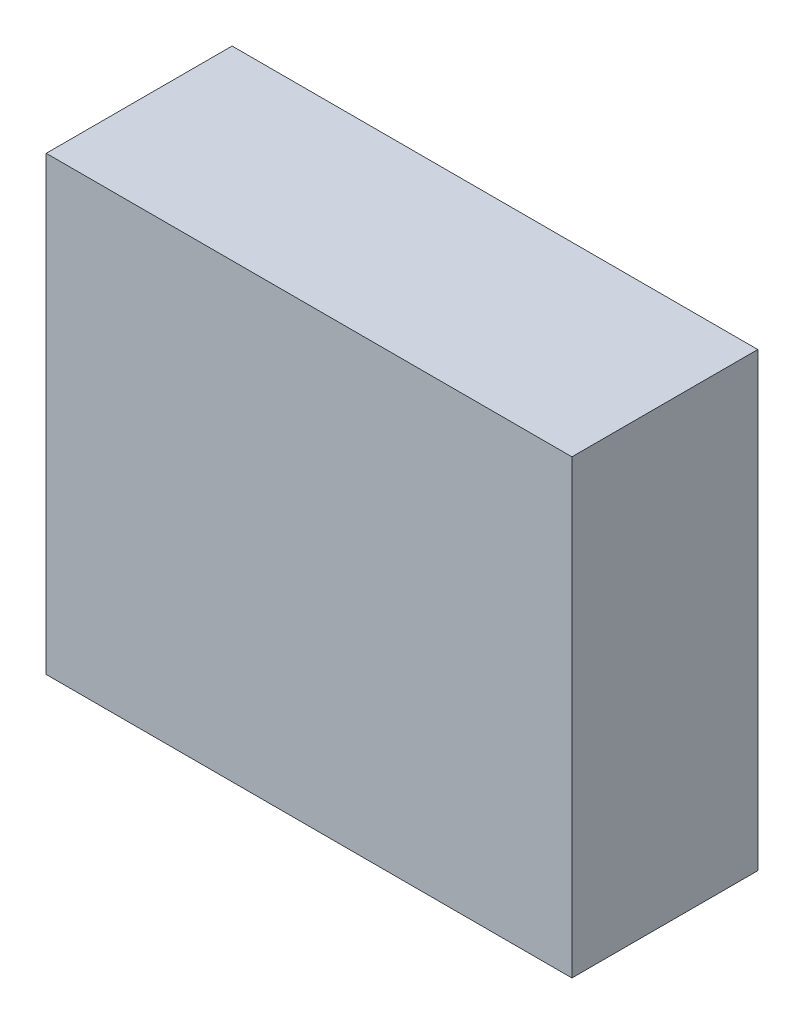
ISO-10303-21;
HEADER;
FILE_DESCRIPTION(('STEP AP214'),'2;1');
FILE_NAME('part.step','',(''),(''),'','','');
FILE_SCHEMA(('AUTOMOTIVE_DESIGN { 1 0 10303 214 1 1 1 1 }'));
ENDSEC;
DATA;
#1=APPLICATION_CONTEXT('core data for automotive mechanical design processes');
#2=APPLICATION_PROTOCOL_DEFINITION('international standard','automotive_design',2000,#1);
#3=PRODUCT_CONTEXT('',#1,'mechanical');
#4=PRODUCT('Part','Part','',(#3));
#5=PRODUCT_RELATED_PRODUCT_CATEGORY('part','',(#4));
#6=PRODUCT_DEFINITION_FORMATION('','',#4);
#7=PRODUCT_DEFINITION_CONTEXT('part definition',#1,'design');
#8=PRODUCT_DEFINITION('design','',#6,#7);
#9=PRODUCT_DEFINITION_SHAPE('','',#8);
#10=(LENGTH_UNIT() NAMED_UNIT(*) SI_UNIT(.MILLI.,.METRE.));
#11=(NAMED_UNIT(*) PLANE_ANGLE_UNIT() SI_UNIT($,.RADIAN.));
#12=(NAMED_UNIT(*) SI_UNIT($,.STERADIAN.) SOLID_ANGLE_UNIT());
#13=UNCERTAINTY_MEASURE_WITH_UNIT(LENGTH_MEASURE(1.E-05),#10,'distance_accuracy_value','');
#14=(GEOMETRIC_REPRESENTATION_CONTEXT(3) GLOBAL_UNCERTAINTY_ASSIGNED_CONTEXT((#13)) GLOBAL_UNIT_ASSIGNED_CONTEXT((#10,
#11,#12)) REPRESENTATION_CONTEXT('',''));
#15=CARTESIAN_POINT('',(0.,0.,0.));
#16=DIRECTION('',(0.,0.,1.));
#17=DIRECTION('',(1.,0.,0.));
#18=AXIS2_PLACEMENT_3D('',#15,#16,#17);
#19=CARTESIAN_POINT('',(49.5,85.,-17.5));
#20=DIRECTION('',(-1.,0.,0.));
#21=DIRECTION('',(0.,0.,1.));
#22=AXIS2_PLACEMENT_3D('',#19,#20,#21);
#23=PLANE('',#22);
#24=DIRECTION('',(0.,0.,-1.));
#25=VECTOR('',#24,1.);
#26=CARTESIAN_POINT('',(49.5,0.,-17.5));
#27=LINE('',#26,#25);
#28=CARTESIAN_POINT('',(49.5,0.,17.5));
#29=VERTEX_POINT('',#28);
#30=CARTESIAN_POINT('',(49.5,0.,-17.5));
#31=VERTEX_POINT('',#30);
#32=EDGE_CURVE('E113',#29,#31,#27,.T.);
#33=ORIENTED_EDGE('',*,*,#32,.T.);
#34=DIRECTION('',(0.,-1.,0.));
#35=VECTOR('',#34,1.);
#36=CARTESIAN_POINT('',(49.5,85.,-17.5));
#37=LINE('',#36,#35);
#38=CARTESIAN_POINT('',(49.5,85.,-17.5));
#39=VERTEX_POINT('',#38);
#40=EDGE_CURVE('E11',#39,#31,#37,.T.);
#41=ORIENTED_EDGE('',*,*,#40,.F.);
#42=DIRECTION('',(0.,0.,-1.));
#43=VECTOR('',#42,1.);
#44=CARTESIAN_POINT('',(49.5,85.,-17.5));
#45=LINE('',#44,#43);
#46=CARTESIAN_POINT('',(49.5,85.,17.5));
#47=VERTEX_POINT('',#46);
#48=EDGE_CURVE('E97',#47,#39,#45,.T.);
#49=ORIENTED_EDGE('',*,*,#48,.F.);
#50=DIRECTION('',(0.,-1.,0.));
#51=VECTOR('',#50,1.);
#52=CARTESIAN_POINT('',(49.5,85.,17.5));
#53=LINE('',#52,#51);
#54=EDGE_CURVE('E109',#47,#29,#53,.T.);
#55=ORIENTED_EDGE('',*,*,#54,.T.);
#56=EDGE_LOOP('',(#33,#41,#49,#55));
#57=FACE_BOUND('',#56,.T.);
#58=ADVANCED_FACE('F45',(#57),#23,.F.);
#59=CARTESIAN_POINT('',(-49.5,85.,-17.5));
#60=DIRECTION('',(0.,0.,1.));
#61=DIRECTION('',(1.,0.,0.));
#62=AXIS2_PLACEMENT_3D('',#59,#60,#61);
#63=PLANE('',#62);
#64=DIRECTION('',(-1.,0.,0.));
#65=VECTOR('',#64,1.);
#66=CARTESIAN_POINT('',(-49.5,0.,-17.5));
#67=LINE('',#66,#65);
#68=CARTESIAN_POINT('',(-49.5,0.,-17.5));
#69=VERTEX_POINT('',#68);
#70=EDGE_CURVE('E102',#31,#69,#67,.T.);
#71=ORIENTED_EDGE('',*,*,#70,.T.);
#72=DIRECTION('',(0.,-1.,0.));
#73=VECTOR('',#72,1.);
#74=CARTESIAN_POINT('',(-49.5,85.,-17.5));
#75=LINE('',#74,#73);
#76=CARTESIAN_POINT('',(-49.5,85.,-17.5));
#77=VERTEX_POINT('',#76);
#78=EDGE_CURVE('E54',#77,#69,#75,.T.);
#79=ORIENTED_EDGE('',*,*,#78,.F.);
#80=DIRECTION('',(-1.,0.,0.));
#81=VECTOR('',#80,1.);
#82=CARTESIAN_POINT('',(-49.5,85.,-17.5));
#83=LINE('',#82,#81);
#84=EDGE_CURVE('E92',#39,#77,#83,.T.);
#85=ORIENTED_EDGE('',*,*,#84,.F.);
#86=ORIENTED_EDGE('',*,*,#40,.T.);
#87=EDGE_LOOP('',(#71,#79,#85,#86));
#88=FACE_BOUND('',#87,.T.);
#89=ADVANCED_FACE('F101',(#88),#63,.F.);
#90=CARTESIAN_POINT('',(-49.5,85.,-17.5));
#91=DIRECTION('',(1.,0.,0.));
#92=DIRECTION('',(0.,0.,-1.));
#93=AXIS2_PLACEMENT_3D('',#90,#91,#92);
#94=PLANE('',#93);
#95=DIRECTION('',(0.,0.,1.));
#96=VECTOR('',#95,1.);
#97=CARTESIAN_POINT('',(-49.5,0.,-17.5));
#98=LINE('',#97,#96);
#99=CARTESIAN_POINT('',(-49.5,0.,17.5));
#100=VERTEX_POINT('',#99);
#101=EDGE_CURVE('E79',#69,#100,#98,.T.);
#102=ORIENTED_EDGE('',*,*,#101,.T.);
#103=DIRECTION('',(0.,-1.,0.));
#104=VECTOR('',#103,1.);
#105=CARTESIAN_POINT('',(-49.5,85.,17.5));
#106=LINE('',#105,#104);
#107=CARTESIAN_POINT('',(-49.5,85.,17.5));
#108=VERTEX_POINT('',#107);
#109=EDGE_CURVE('E104',#108,#100,#106,.T.);
#110=ORIENTED_EDGE('',*,*,#109,.F.);
#111=DIRECTION('',(0.,0.,1.));
#112=VECTOR('',#111,1.);
#113=CARTESIAN_POINT('',(-49.5,85.,-17.5));
#114=LINE('',#113,#112);
#115=EDGE_CURVE('E95',#77,#108,#114,.T.);
#116=ORIENTED_EDGE('',*,*,#115,.F.);
#117=ORIENTED_EDGE('',*,*,#78,.T.);
#118=EDGE_LOOP('',(#102,#110,#116,#117));
#119=FACE_BOUND('',#118,.T.);
#120=ADVANCED_FACE('F105',(#119),#94,.F.);
#121=CARTESIAN_POINT('',(-49.5,85.,17.5));
#122=DIRECTION('',(0.,0.,-1.));
#123=DIRECTION('',(-1.,0.,0.));
#124=AXIS2_PLACEMENT_3D('',#121,#122,#123);
#125=PLANE('',#124);
#126=DIRECTION('',(1.,0.,0.));
#127=VECTOR('',#126,1.);
#128=CARTESIAN_POINT('',(-49.5,0.,17.5));
#129=LINE('',#128,#127);
#130=EDGE_CURVE('E85',#100,#29,#129,.T.);
#131=ORIENTED_EDGE('',*,*,#130,.T.);
#132=ORIENTED_EDGE('',*,*,#54,.F.);
#133=DIRECTION('',(1.,0.,0.));
#134=VECTOR('',#133,1.);
#135=CARTESIAN_POINT('',(-49.5,85.,17.5));
#136=LINE('',#135,#134);
#137=EDGE_CURVE('E62',#108,#47,#136,.T.);
#138=ORIENTED_EDGE('',*,*,#137,.F.);
#139=ORIENTED_EDGE('',*,*,#109,.T.);
#140=EDGE_LOOP('',(#131,#132,#138,#139));
#141=FACE_BOUND('',#140,.T.);
#142=ADVANCED_FACE('F126',(#141),#125,.F.);
#143=CARTESIAN_POINT('',(0.,85.,0.));
#144=DIRECTION('',(0.,1.,0.));
#145=DIRECTION('',(0.,0.,1.));
#146=AXIS2_PLACEMENT_3D('',#143,#144,#145);
#147=PLANE('',#146);
#148=ORIENTED_EDGE('',*,*,#48,.T.);
#149=ORIENTED_EDGE('',*,*,#84,.T.);
#150=ORIENTED_EDGE('',*,*,#115,.T.);
#151=ORIENTED_EDGE('',*,*,#137,.T.);
#152=EDGE_LOOP('',(#148,#149,#150,#151));
#153=FACE_BOUND('',#152,.T.);
#154=ADVANCED_FACE('F93',(#153),#147,.T.);
#155=CARTESIAN_POINT('',(0.,0.,0.));
#156=DIRECTION('',(0.,1.,0.));
#157=DIRECTION('',(0.,0.,1.));
#158=AXIS2_PLACEMENT_3D('',#155,#156,#157);
#159=PLANE('',#158);
#160=ORIENTED_EDGE('',*,*,#32,.F.);
#161=ORIENTED_EDGE('',*,*,#130,.F.);
#162=ORIENTED_EDGE('',*,*,#101,.F.);
#163=ORIENTED_EDGE('',*,*,#70,.F.);
#164=EDGE_LOOP('',(#160,#161,#162,#163));
#165=FACE_BOUND('',#164,.T.);
#166=ADVANCED_FACE('F129',(#165),#159,.F.);
#167=CLOSED_SHELL('',(#58,#89,#120,#142,#154,#166));
#168=MANIFOLD_SOLID_BREP('B2',#167);
#169=ADVANCED_BREP_SHAPE_REPRESENTATION('',(#18,#168),#14);
#170=SHAPE_DEFINITION_REPRESENTATION(#9,#169);
ENDSEC;
END-ISO-10303-21;
